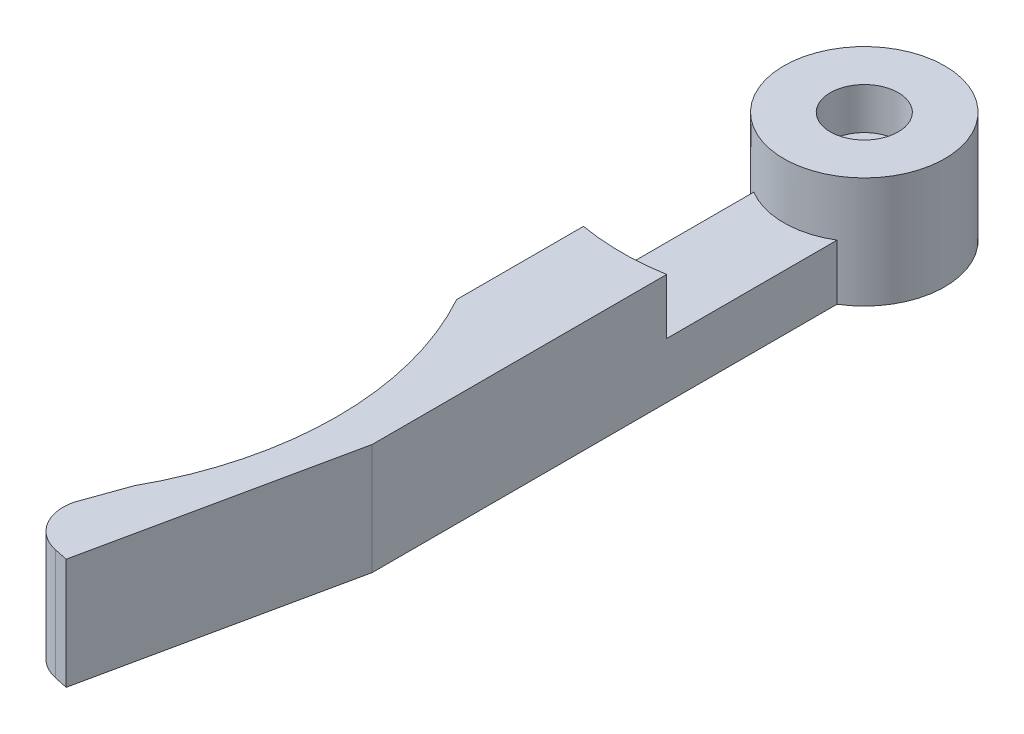
ISO-10303-21;
HEADER;
FILE_DESCRIPTION(('STEP AP214'),'2;1');
FILE_NAME('part.step','',(''),(''),'','','');
FILE_SCHEMA(('AUTOMOTIVE_DESIGN { 1 0 10303 214 1 1 1 1 }'));
ENDSEC;
DATA;
#1=APPLICATION_CONTEXT('core data for automotive mechanical design processes');
#2=APPLICATION_PROTOCOL_DEFINITION('international standard','automotive_design',2000,#1);
#3=PRODUCT_CONTEXT('',#1,'mechanical');
#4=PRODUCT('Part','Part','',(#3));
#5=PRODUCT_RELATED_PRODUCT_CATEGORY('part','',(#4));
#6=PRODUCT_DEFINITION_FORMATION('','',#4);
#7=PRODUCT_DEFINITION_CONTEXT('part definition',#1,'design');
#8=PRODUCT_DEFINITION('design','',#6,#7);
#9=PRODUCT_DEFINITION_SHAPE('','',#8);
#10=(LENGTH_UNIT() NAMED_UNIT(*) SI_UNIT(.MILLI.,.METRE.));
#11=(NAMED_UNIT(*) PLANE_ANGLE_UNIT() SI_UNIT($,.RADIAN.));
#12=(NAMED_UNIT(*) SI_UNIT($,.STERADIAN.) SOLID_ANGLE_UNIT());
#13=UNCERTAINTY_MEASURE_WITH_UNIT(LENGTH_MEASURE(1.E-05),#10,'distance_accuracy_value','');
#14=(GEOMETRIC_REPRESENTATION_CONTEXT(3) GLOBAL_UNCERTAINTY_ASSIGNED_CONTEXT((#13)) GLOBAL_UNIT_ASSIGNED_CONTEXT((#10,
#11,#12)) REPRESENTATION_CONTEXT('',''));
#15=CARTESIAN_POINT('',(0.,0.,0.));
#16=DIRECTION('',(0.,0.,1.));
#17=DIRECTION('',(1.,0.,0.));
#18=AXIS2_PLACEMENT_3D('',#15,#16,#17);
#19=CARTESIAN_POINT('',(0.,8.,0.));
#20=DIRECTION('',(0.,1.,0.));
#21=DIRECTION('',(0.,0.,-1.));
#22=AXIS2_PLACEMENT_3D('',#19,#20,#21);
#23=PLANE('',#22);
#24=CARTESIAN_POINT('',(0.,8.,0.));
#25=DIRECTION('',(0.,-1.,0.));
#26=DIRECTION('',(0.,0.,-1.));
#27=AXIS2_PLACEMENT_3D('',#24,#25,#26);
#28=CIRCLE('',#27,5.8);
#29=CARTESIAN_POINT('',(0.,8.,-5.8));
#30=VERTEX_POINT('',#29);
#31=EDGE_CURVE('E164',#30,#30,#28,.T.);
#32=ORIENTED_EDGE('',*,*,#31,.F.);
#33=EDGE_LOOP('',(#32));
#34=FACE_BOUND('',#33,.T.);
#35=CARTESIAN_POINT('',(0.,8.,0.));
#36=DIRECTION('',(0.,-1.,0.));
#37=DIRECTION('',(0.,0.,-1.));
#38=AXIS2_PLACEMENT_3D('',#35,#36,#37);
#39=CIRCLE('',#38,2.45000000000001);
#40=CARTESIAN_POINT('',(0.,8.,-2.45000000000003));
#41=VERTEX_POINT('',#40);
#42=EDGE_CURVE('E230',#41,#41,#39,.T.);
#43=ORIENTED_EDGE('',*,*,#42,.T.);
#44=EDGE_LOOP('',(#43));
#45=FACE_BOUND('',#44,.T.);
#46=ADVANCED_FACE('F37',(#34,#45),#23,.T.);
#47=CARTESIAN_POINT('',(0.,-0.00100000000000013,0.));
#48=DIRECTION('',(0.,1.,0.));
#49=DIRECTION('',(0.,0.,-1.));
#50=AXIS2_PLACEMENT_3D('',#47,#48,#49);
#51=CYLINDRICAL_SURFACE('',#50,1.25);
#52=CARTESIAN_POINT('',(0.,5.,0.));
#53=DIRECTION('',(0.,-1.,0.));
#54=DIRECTION('',(0.,0.,-1.));
#55=AXIS2_PLACEMENT_3D('',#52,#53,#54);
#56=CIRCLE('',#55,1.25);
#57=CARTESIAN_POINT('',(0.,5.,-1.25000000000002));
#58=VERTEX_POINT('',#57);
#59=EDGE_CURVE('E227',#58,#58,#56,.T.);
#60=ORIENTED_EDGE('',*,*,#59,.F.);
#61=EDGE_LOOP('',(#60));
#62=FACE_BOUND('',#61,.T.);
#63=CARTESIAN_POINT('',(0.,2.,0.));
#64=DIRECTION('',(0.,1.,0.));
#65=DIRECTION('',(0.,0.,1.));
#66=AXIS2_PLACEMENT_3D('',#63,#64,#65);
#67=CIRCLE('',#66,1.25);
#68=CARTESIAN_POINT('',(0.,2.,1.24999999999998));
#69=VERTEX_POINT('',#68);
#70=EDGE_CURVE('E41',#69,#69,#67,.F.);
#71=ORIENTED_EDGE('',*,*,#70,.T.);
#72=EDGE_LOOP('',(#71));
#73=FACE_BOUND('',#72,.T.);
#74=ADVANCED_FACE('F241',(#62,#73),#51,.F.);
#75=CARTESIAN_POINT('',(0.,8.,0.));
#76=DIRECTION('',(0.,-1.,0.));
#77=DIRECTION('',(0.,0.,1.));
#78=AXIS2_PLACEMENT_3D('',#75,#76,#77);
#79=CYLINDRICAL_SURFACE('',#78,5.8);
#80=DIRECTION('',(0.,-1.,0.));
#81=VECTOR('',#80,1.);
#82=CARTESIAN_POINT('',(2.99999999999999,8.,4.96386945839635));
#83=LINE('',#82,#81);
#84=CARTESIAN_POINT('',(2.99999999999999,4.,4.96386945839635));
#85=VERTEX_POINT('',#84);
#86=CARTESIAN_POINT('',(2.99999999999999,0.,4.96386945839635));
#87=VERTEX_POINT('',#86);
#88=EDGE_CURVE('E11',#85,#87,#83,.T.);
#89=ORIENTED_EDGE('',*,*,#88,.T.);
#90=CARTESIAN_POINT('',(0.,0.,0.));
#91=DIRECTION('',(0.,-1.,0.));
#92=DIRECTION('',(0.,0.,-1.));
#93=AXIS2_PLACEMENT_3D('',#90,#91,#92);
#94=CIRCLE('',#93,5.8);
#95=CARTESIAN_POINT('',(-2.99999999999999,0.,4.96386945839635));
#96=VERTEX_POINT('',#95);
#97=EDGE_CURVE('E146',#96,#87,#94,.T.);
#98=ORIENTED_EDGE('',*,*,#97,.F.);
#99=DIRECTION('',(0.,-1.,0.));
#100=VECTOR('',#99,1.);
#101=CARTESIAN_POINT('',(-2.99999999999999,8.,4.96386945839635));
#102=LINE('',#101,#100);
#103=CARTESIAN_POINT('',(-2.99999999999999,4.,4.96386945839635));
#104=VERTEX_POINT('',#103);
#105=EDGE_CURVE('E145',#104,#96,#102,.T.);
#106=ORIENTED_EDGE('',*,*,#105,.F.);
#107=CARTESIAN_POINT('',(0.,4.,0.));
#108=DIRECTION('',(0.,1.,0.));
#109=DIRECTION('',(0.,0.,1.));
#110=AXIS2_PLACEMENT_3D('',#107,#108,#109);
#111=CIRCLE('',#110,5.80000000000002);
#112=EDGE_CURVE('E191',#104,#85,#111,.T.);
#113=ORIENTED_EDGE('',*,*,#112,.T.);
#114=EDGE_LOOP('',(#89,#98,#106,#113));
#115=FACE_BOUND('',#114,.T.);
#116=ORIENTED_EDGE('',*,*,#31,.T.);
#117=EDGE_LOOP('',(#116));
#118=FACE_BOUND('',#117,.T.);
#119=ADVANCED_FACE('F39',(#115,#118),#79,.T.);
#120=CARTESIAN_POINT('',(3.,8.,38.4638694583963));
#121=DIRECTION('',(-1.,0.,0.));
#122=DIRECTION('',(0.,0.,-1.));
#123=AXIS2_PLACEMENT_3D('',#120,#121,#122);
#124=PLANE('',#123);
#125=DIRECTION('',(0.,0.,1.));
#126=VECTOR('',#125,1.);
#127=CARTESIAN_POINT('',(3.,8.,38.4638694583963));
#128=LINE('',#127,#126);
#129=CARTESIAN_POINT('',(3.,8.,17.2409396495667));
#130=VERTEX_POINT('',#129);
#131=CARTESIAN_POINT('',(3.,8.,38.4638694583963));
#132=VERTEX_POINT('',#131);
#133=EDGE_CURVE('E179',#130,#132,#128,.T.);
#134=ORIENTED_EDGE('',*,*,#133,.T.);
#135=DIRECTION('',(0.,-1.,0.));
#136=VECTOR('',#135,1.);
#137=CARTESIAN_POINT('',(3.,8.,38.4638694583963));
#138=LINE('',#137,#136);
#139=CARTESIAN_POINT('',(3.,0.,38.4638694583963));
#140=VERTEX_POINT('',#139);
#141=EDGE_CURVE('E46',#132,#140,#138,.T.);
#142=ORIENTED_EDGE('',*,*,#141,.T.);
#143=DIRECTION('',(0.,0.,1.));
#144=VECTOR('',#143,1.);
#145=CARTESIAN_POINT('',(3.,0.,38.4638694583963));
#146=LINE('',#145,#144);
#147=EDGE_CURVE('E148',#87,#140,#146,.T.);
#148=ORIENTED_EDGE('',*,*,#147,.F.);
#149=ORIENTED_EDGE('',*,*,#88,.F.);
#150=DIRECTION('',(0.,0.,1.));
#151=VECTOR('',#150,1.);
#152=CARTESIAN_POINT('',(2.99999999999999,4.,4.96386945839635));
#153=LINE('',#152,#151);
#154=CARTESIAN_POINT('',(2.99999999999999,4.,17.2409396495667));
#155=VERTEX_POINT('',#154);
#156=EDGE_CURVE('E195',#85,#155,#153,.T.);
#157=ORIENTED_EDGE('',*,*,#156,.T.);
#158=DIRECTION('',(0.,1.,0.));
#159=VECTOR('',#158,1.);
#160=CARTESIAN_POINT('',(2.99999999999999,4.,17.2409396495667));
#161=LINE('',#160,#159);
#162=EDGE_CURVE('E210',#155,#130,#161,.T.);
#163=ORIENTED_EDGE('',*,*,#162,.T.);
#164=EDGE_LOOP('',(#134,#142,#148,#149,#157,#163));
#165=FACE_BOUND('',#164,.T.);
#166=ADVANCED_FACE('F177',(#165),#124,.F.);
#167=CARTESIAN_POINT('',(-0.867157449210331,8.,56.6574148320451));
#168=DIRECTION('',(-0.978147600733806,0.,-0.20791169081776));
#169=DIRECTION('',(0.20791169081776,0.,-0.978147600733806));
#170=AXIS2_PLACEMENT_3D('',#167,#168,#169);
#171=PLANE('',#170);
#172=DIRECTION('',(-0.20791169081776,0.,0.978147600733805));
#173=VECTOR('',#172,1.);
#174=CARTESIAN_POINT('',(-0.867157449210331,0.,56.6574148320451));
#175=LINE('',#174,#173);
#176=CARTESIAN_POINT('',(-0.867157449210331,0.,56.6574148320451));
#177=VERTEX_POINT('',#176);
#178=EDGE_CURVE('E152',#140,#177,#175,.T.);
#179=ORIENTED_EDGE('',*,*,#178,.F.);
#180=ORIENTED_EDGE('',*,*,#141,.F.);
#181=DIRECTION('',(-0.20791169081776,0.,0.978147600733805));
#182=VECTOR('',#181,1.);
#183=CARTESIAN_POINT('',(-0.867157449210331,8.,56.6574148320451));
#184=LINE('',#183,#182);
#185=CARTESIAN_POINT('',(-0.867157449210331,8.,56.6574148320451));
#186=VERTEX_POINT('',#185);
#187=EDGE_CURVE('E102',#132,#186,#184,.T.);
#188=ORIENTED_EDGE('',*,*,#187,.T.);
#189=DIRECTION('',(0.,-1.,0.));
#190=VECTOR('',#189,1.);
#191=CARTESIAN_POINT('',(-0.867157449210331,8.,56.6574148320451));
#192=LINE('',#191,#190);
#193=EDGE_CURVE('E171',#186,#177,#192,.T.);
#194=ORIENTED_EDGE('',*,*,#193,.T.);
#195=EDGE_LOOP('',(#179,#180,#188,#194));
#196=FACE_BOUND('',#195,.T.);
#197=ADVANCED_FACE('F181',(#196),#171,.F.);
#198=CARTESIAN_POINT('',(-1.84530504994414,8.,56.4495031412274));
#199=DIRECTION('',(0.207911690817762,0.,-0.978147600733805));
#200=DIRECTION('',(0.978147600733805,0.,0.207911690817762));
#201=AXIS2_PLACEMENT_3D('',#198,#199,#200);
#202=PLANE('',#201);
#203=DIRECTION('',(-0.978147600733805,0.,-0.207911690817762));
#204=VECTOR('',#203,1.);
#205=CARTESIAN_POINT('',(-1.84530504994414,0.,56.4495031412274));
#206=LINE('',#205,#204);
#207=CARTESIAN_POINT('',(-1.84530504994414,0.,56.4495031412274));
#208=VERTEX_POINT('',#207);
#209=EDGE_CURVE('E155',#177,#208,#206,.T.);
#210=ORIENTED_EDGE('',*,*,#209,.F.);
#211=ORIENTED_EDGE('',*,*,#193,.F.);
#212=DIRECTION('',(-0.978147600733805,0.,-0.207911690817762));
#213=VECTOR('',#212,1.);
#214=CARTESIAN_POINT('',(-1.84530504994414,8.,56.4495031412274));
#215=LINE('',#214,#213);
#216=CARTESIAN_POINT('',(-1.84530504994414,8.,56.4495031412274));
#217=VERTEX_POINT('',#216);
#218=EDGE_CURVE('E138',#186,#217,#215,.T.);
#219=ORIENTED_EDGE('',*,*,#218,.T.);
#220=DIRECTION('',(0.,-1.,0.));
#221=VECTOR('',#220,1.);
#222=CARTESIAN_POINT('',(-1.84530504994414,8.,56.4495031412274));
#223=LINE('',#222,#221);
#224=EDGE_CURVE('E132',#217,#208,#223,.T.);
#225=ORIENTED_EDGE('',*,*,#224,.T.);
#226=EDGE_LOOP('',(#210,#211,#219,#225));
#227=FACE_BOUND('',#226,.T.);
#228=ADVANCED_FACE('F272',(#227),#202,.F.);
#229=CARTESIAN_POINT('',(-1.22156997749086,8.,53.515060339026));
#230=DIRECTION('',(0.,-1.,0.));
#231=DIRECTION('',(0.,0.,1.));
#232=AXIS2_PLACEMENT_3D('',#229,#230,#231);
#233=CYLINDRICAL_SURFACE('',#232,3.);
#234=CARTESIAN_POINT('',(-1.22156997749086,0.,53.515060339026));
#235=DIRECTION('',(0.,-1.,0.));
#236=DIRECTION('',(0.,0.,1.));
#237=AXIS2_PLACEMENT_3D('',#234,#235,#236);
#238=CIRCLE('',#237,3.);
#239=CARTESIAN_POINT('',(-4.14041417555798,0.,52.8219885192194));
#240=VERTEX_POINT('',#239);
#241=EDGE_CURVE('E158',#208,#240,#238,.T.);
#242=ORIENTED_EDGE('',*,*,#241,.F.);
#243=ORIENTED_EDGE('',*,*,#224,.F.);
#244=CARTESIAN_POINT('',(-1.22156997749086,8.,53.515060339026));
#245=DIRECTION('',(0.,-1.,0.));
#246=DIRECTION('',(0.,0.,1.));
#247=AXIS2_PLACEMENT_3D('',#244,#245,#246);
#248=CIRCLE('',#247,3.);
#249=CARTESIAN_POINT('',(-4.14041417555798,8.,52.8219885192194));
#250=VERTEX_POINT('',#249);
#251=EDGE_CURVE('E117',#217,#250,#248,.T.);
#252=ORIENTED_EDGE('',*,*,#251,.T.);
#253=DIRECTION('',(0.,-1.,0.));
#254=VECTOR('',#253,1.);
#255=CARTESIAN_POINT('',(-4.14041417555798,8.,52.8219885192194));
#256=LINE('',#255,#254);
#257=EDGE_CURVE('E126',#250,#240,#256,.T.);
#258=ORIENTED_EDGE('',*,*,#257,.T.);
#259=EDGE_LOOP('',(#242,#243,#252,#258));
#260=FACE_BOUND('',#259,.T.);
#261=ADVANCED_FACE('F135',(#260),#233,.T.);
#262=CARTESIAN_POINT('',(-4.14041417555798,8.,52.8219885192194));
#263=DIRECTION('',(0.942070141352118,0.,0.33541593398764));
#264=DIRECTION('',(-0.33541593398764,0.,0.942070141352118));
#265=AXIS2_PLACEMENT_3D('',#262,#263,#264);
#266=PLANE('',#265);
#267=DIRECTION('',(0.33541593398764,0.,-0.942070141352118));
#268=VECTOR('',#267,1.);
#269=CARTESIAN_POINT('',(-4.14041417555798,0.,52.8219885192194));
#270=LINE('',#269,#268);
#271=CARTESIAN_POINT('',(-3.,0.,49.6189500386222));
#272=VERTEX_POINT('',#271);
#273=EDGE_CURVE('E129',#240,#272,#270,.T.);
#274=ORIENTED_EDGE('',*,*,#273,.F.);
#275=ORIENTED_EDGE('',*,*,#257,.F.);
#276=DIRECTION('',(0.33541593398764,0.,-0.942070141352118));
#277=VECTOR('',#276,1.);
#278=CARTESIAN_POINT('',(-4.14041417555798,8.,52.8219885192194));
#279=LINE('',#278,#277);
#280=CARTESIAN_POINT('',(-3.,8.,49.6189500386222));
#281=VERTEX_POINT('',#280);
#282=EDGE_CURVE('E113',#250,#281,#279,.T.);
#283=ORIENTED_EDGE('',*,*,#282,.T.);
#284=DIRECTION('',(0.,-1.,0.));
#285=VECTOR('',#284,1.);
#286=CARTESIAN_POINT('',(-3.,8.,49.6189500386222));
#287=LINE('',#286,#285);
#288=EDGE_CURVE('E133',#281,#272,#287,.T.);
#289=ORIENTED_EDGE('',*,*,#288,.T.);
#290=EDGE_LOOP('',(#274,#275,#283,#289));
#291=FACE_BOUND('',#290,.T.);
#292=ADVANCED_FACE('F127',(#291),#266,.F.);
#293=CARTESIAN_POINT('',(-24.,8.,38.));
#294=DIRECTION('',(0.,-1.,0.));
#295=DIRECTION('',(0.,0.,1.));
#296=AXIS2_PLACEMENT_3D('',#293,#294,#295);
#297=CYLINDRICAL_SURFACE('',#296,24.);
#298=CARTESIAN_POINT('',(-24.,0.,38.));
#299=DIRECTION('',(0.,1.,0.));
#300=DIRECTION('',(0.,0.,1.));
#301=AXIS2_PLACEMENT_3D('',#298,#299,#300);
#302=CIRCLE('',#301,24.);
#303=CARTESIAN_POINT('',(-2.99999999999999,0.,26.3810499613777));
#304=VERTEX_POINT('',#303);
#305=EDGE_CURVE('E161',#272,#304,#302,.T.);
#306=ORIENTED_EDGE('',*,*,#305,.F.);
#307=ORIENTED_EDGE('',*,*,#288,.F.);
#308=CARTESIAN_POINT('',(-24.,8.,38.));
#309=DIRECTION('',(0.,1.,0.));
#310=DIRECTION('',(0.,0.,1.));
#311=AXIS2_PLACEMENT_3D('',#308,#309,#310);
#312=CIRCLE('',#311,24.);
#313=CARTESIAN_POINT('',(-2.99999999999999,8.,26.3810499613777));
#314=VERTEX_POINT('',#313);
#315=EDGE_CURVE('E120',#281,#314,#312,.T.);
#316=ORIENTED_EDGE('',*,*,#315,.T.);
#317=DIRECTION('',(0.,-1.,0.));
#318=VECTOR('',#317,1.);
#319=CARTESIAN_POINT('',(-2.99999999999999,8.,26.3810499613777));
#320=LINE('',#319,#318);
#321=EDGE_CURVE('E166',#314,#304,#320,.T.);
#322=ORIENTED_EDGE('',*,*,#321,.T.);
#323=EDGE_LOOP('',(#306,#307,#316,#322));
#324=FACE_BOUND('',#323,.T.);
#325=ADVANCED_FACE('F264',(#324),#297,.F.);
#326=CARTESIAN_POINT('',(-2.99999999999999,8.,26.3810499613777));
#327=DIRECTION('',(1.,0.,0.));
#328=DIRECTION('',(0.,0.,1.));
#329=AXIS2_PLACEMENT_3D('',#326,#327,#328);
#330=PLANE('',#329);
#331=DIRECTION('',(0.,0.,-1.));
#332=VECTOR('',#331,1.);
#333=CARTESIAN_POINT('',(-2.99999999999999,4.,4.96386945839635));
#334=LINE('',#333,#332);
#335=CARTESIAN_POINT('',(-2.99999999999999,4.,17.2409396495666));
#336=VERTEX_POINT('',#335);
#337=EDGE_CURVE('E207',#336,#104,#334,.T.);
#338=ORIENTED_EDGE('',*,*,#337,.T.);
#339=ORIENTED_EDGE('',*,*,#105,.T.);
#340=DIRECTION('',(0.,0.,-1.));
#341=VECTOR('',#340,1.);
#342=CARTESIAN_POINT('',(-2.99999999999999,0.,26.3810499613777));
#343=LINE('',#342,#341);
#344=EDGE_CURVE('E94',#304,#96,#343,.T.);
#345=ORIENTED_EDGE('',*,*,#344,.F.);
#346=ORIENTED_EDGE('',*,*,#321,.F.);
#347=DIRECTION('',(0.,0.,-1.));
#348=VECTOR('',#347,1.);
#349=CARTESIAN_POINT('',(-2.99999999999999,8.,26.3810499613777));
#350=LINE('',#349,#348);
#351=CARTESIAN_POINT('',(-2.99999999999999,8.,17.2409396495666));
#352=VERTEX_POINT('',#351);
#353=EDGE_CURVE('E61',#314,#352,#350,.T.);
#354=ORIENTED_EDGE('',*,*,#353,.T.);
#355=DIRECTION('',(0.,1.,0.));
#356=VECTOR('',#355,1.);
#357=CARTESIAN_POINT('',(-2.99999999999999,4.,17.2409396495666));
#358=LINE('',#357,#356);
#359=EDGE_CURVE('E209',#336,#352,#358,.T.);
#360=ORIENTED_EDGE('',*,*,#359,.F.);
#361=EDGE_LOOP('',(#338,#339,#345,#346,#354,#360));
#362=FACE_BOUND('',#361,.T.);
#363=ADVANCED_FACE('F208',(#362),#330,.F.);
#364=CARTESIAN_POINT('',(0.,8.,0.));
#365=DIRECTION('',(0.,-1.,0.));
#366=DIRECTION('',(0.,0.,1.));
#367=AXIS2_PLACEMENT_3D('',#364,#365,#366);
#368=CIRCLE('',#367,17.5);
#369=EDGE_CURVE('E53',#130,#352,#368,.T.);
#370=ORIENTED_EDGE('',*,*,#369,.T.);
#371=ORIENTED_EDGE('',*,*,#353,.F.);
#372=ORIENTED_EDGE('',*,*,#315,.F.);
#373=ORIENTED_EDGE('',*,*,#282,.F.);
#374=ORIENTED_EDGE('',*,*,#251,.F.);
#375=ORIENTED_EDGE('',*,*,#218,.F.);
#376=ORIENTED_EDGE('',*,*,#187,.F.);
#377=ORIENTED_EDGE('',*,*,#133,.F.);
#378=EDGE_LOOP('',(#370,#371,#372,#373,#374,#375,#376,#377));
#379=FACE_BOUND('',#378,.T.);
#380=ADVANCED_FACE('F115',(#379),#23,.T.);
#381=CARTESIAN_POINT('',(0.,0.,0.));
#382=DIRECTION('',(0.,1.,0.));
#383=DIRECTION('',(0.,0.,-1.));
#384=AXIS2_PLACEMENT_3D('',#381,#382,#383);
#385=PLANE('',#384);
#386=CARTESIAN_POINT('',(0.,0.,0.));
#387=DIRECTION('',(0.,1.,0.));
#388=DIRECTION('',(0.,0.,1.));
#389=AXIS2_PLACEMENT_3D('',#386,#387,#388);
#390=CIRCLE('',#389,3.);
#391=CARTESIAN_POINT('',(0.,0.,2.99999999999998));
#392=VERTEX_POINT('',#391);
#393=EDGE_CURVE('E220',#392,#392,#390,.T.);
#394=ORIENTED_EDGE('',*,*,#393,.T.);
#395=EDGE_LOOP('',(#394));
#396=FACE_BOUND('',#395,.T.);
#397=ORIENTED_EDGE('',*,*,#97,.T.);
#398=ORIENTED_EDGE('',*,*,#147,.T.);
#399=ORIENTED_EDGE('',*,*,#178,.T.);
#400=ORIENTED_EDGE('',*,*,#209,.T.);
#401=ORIENTED_EDGE('',*,*,#241,.T.);
#402=ORIENTED_EDGE('',*,*,#273,.T.);
#403=ORIENTED_EDGE('',*,*,#305,.T.);
#404=ORIENTED_EDGE('',*,*,#344,.T.);
#405=EDGE_LOOP('',(#397,#398,#399,#400,#401,#402,#403,#404));
#406=FACE_BOUND('',#405,.T.);
#407=ADVANCED_FACE('F183',(#396,#406),#385,.F.);
#408=CARTESIAN_POINT('',(0.,5.,0.));
#409=DIRECTION('',(0.,1.,0.));
#410=DIRECTION('',(0.,0.,-1.));
#411=AXIS2_PLACEMENT_3D('',#408,#409,#410);
#412=CYLINDRICAL_SURFACE('',#411,2.45000000000001);
#413=CARTESIAN_POINT('',(0.,5.,0.));
#414=DIRECTION('',(0.,-1.,0.));
#415=DIRECTION('',(0.,0.,-1.));
#416=AXIS2_PLACEMENT_3D('',#413,#414,#415);
#417=CIRCLE('',#416,2.45000000000001);
#418=CARTESIAN_POINT('',(0.,5.,-2.45000000000003));
#419=VERTEX_POINT('',#418);
#420=EDGE_CURVE('E149',#419,#419,#417,.T.);
#421=ORIENTED_EDGE('',*,*,#420,.T.);
#422=EDGE_LOOP('',(#421));
#423=FACE_BOUND('',#422,.T.);
#424=ORIENTED_EDGE('',*,*,#42,.F.);
#425=EDGE_LOOP('',(#424));
#426=FACE_BOUND('',#425,.T.);
#427=ADVANCED_FACE('F245',(#423,#426),#412,.F.);
#428=CARTESIAN_POINT('',(0.,5.,0.));
#429=DIRECTION('',(0.,1.,0.));
#430=DIRECTION('',(0.,0.,-1.));
#431=AXIS2_PLACEMENT_3D('',#428,#429,#430);
#432=PLANE('',#431);
#433=ORIENTED_EDGE('',*,*,#59,.T.);
#434=EDGE_LOOP('',(#433));
#435=FACE_BOUND('',#434,.T.);
#436=ORIENTED_EDGE('',*,*,#420,.F.);
#437=EDGE_LOOP('',(#436));
#438=FACE_BOUND('',#437,.T.);
#439=ADVANCED_FACE('F247',(#435,#438),#432,.T.);
#440=CARTESIAN_POINT('',(0.,2.,0.));
#441=DIRECTION('',(0.,-1.,0.));
#442=DIRECTION('',(0.,0.,1.));
#443=AXIS2_PLACEMENT_3D('',#440,#441,#442);
#444=PLANE('',#443);
#445=CARTESIAN_POINT('',(0.,2.,0.));
#446=DIRECTION('',(0.,1.,0.));
#447=DIRECTION('',(0.,0.,1.));
#448=AXIS2_PLACEMENT_3D('',#445,#446,#447);
#449=CIRCLE('',#448,3.);
#450=CARTESIAN_POINT('',(0.,2.,2.99999999999998));
#451=VERTEX_POINT('',#450);
#452=EDGE_CURVE('E222',#451,#451,#449,.T.);
#453=ORIENTED_EDGE('',*,*,#452,.F.);
#454=EDGE_LOOP('',(#453));
#455=FACE_BOUND('',#454,.T.);
#456=ORIENTED_EDGE('',*,*,#70,.F.);
#457=EDGE_LOOP('',(#456));
#458=FACE_BOUND('',#457,.T.);
#459=ADVANCED_FACE('F254',(#455,#458),#444,.T.);
#460=CARTESIAN_POINT('',(0.,2.,0.));
#461=DIRECTION('',(0.,-1.,0.));
#462=DIRECTION('',(0.,0.,1.));
#463=AXIS2_PLACEMENT_3D('',#460,#461,#462);
#464=CYLINDRICAL_SURFACE('',#463,3.);
#465=ORIENTED_EDGE('',*,*,#452,.T.);
#466=EDGE_LOOP('',(#465));
#467=FACE_BOUND('',#466,.T.);
#468=ORIENTED_EDGE('',*,*,#393,.F.);
#469=EDGE_LOOP('',(#468));
#470=FACE_BOUND('',#469,.T.);
#471=ADVANCED_FACE('F290',(#467,#470),#464,.F.);
#472=CARTESIAN_POINT('',(0.,4.,0.));
#473=DIRECTION('',(0.,1.,0.));
#474=DIRECTION('',(0.,0.,-1.));
#475=AXIS2_PLACEMENT_3D('',#472,#473,#474);
#476=CYLINDRICAL_SURFACE('',#475,17.5);
#477=ORIENTED_EDGE('',*,*,#369,.F.);
#478=ORIENTED_EDGE('',*,*,#162,.F.);
#479=CARTESIAN_POINT('',(0.,4.,0.));
#480=DIRECTION('',(0.,-1.,0.));
#481=DIRECTION('',(0.,0.,1.));
#482=AXIS2_PLACEMENT_3D('',#479,#480,#481);
#483=CIRCLE('',#482,17.5);
#484=EDGE_CURVE('E211',#155,#336,#483,.T.);
#485=ORIENTED_EDGE('',*,*,#484,.T.);
#486=ORIENTED_EDGE('',*,*,#359,.T.);
#487=EDGE_LOOP('',(#477,#478,#485,#486));
#488=FACE_BOUND('',#487,.T.);
#489=ADVANCED_FACE('F293',(#488),#476,.F.);
#490=CARTESIAN_POINT('',(0.,4.,0.));
#491=DIRECTION('',(0.,-1.,0.));
#492=DIRECTION('',(0.,0.,1.));
#493=AXIS2_PLACEMENT_3D('',#490,#491,#492);
#494=PLANE('',#493);
#495=ORIENTED_EDGE('',*,*,#112,.F.);
#496=ORIENTED_EDGE('',*,*,#337,.F.);
#497=ORIENTED_EDGE('',*,*,#484,.F.);
#498=ORIENTED_EDGE('',*,*,#156,.F.);
#499=EDGE_LOOP('',(#495,#496,#497,#498));
#500=FACE_BOUND('',#499,.T.);
#501=ADVANCED_FACE('F213',(#500),#494,.F.);
#502=CLOSED_SHELL('',(#46,#74,#119,#166,#197,#228,#261,#292,#325,#363,#380,#407,#427,#439,#459,
#471,#489,#501));
#503=MANIFOLD_SOLID_BREP('B2',#502);
#504=ADVANCED_BREP_SHAPE_REPRESENTATION('',(#18,#503),#14);
#505=SHAPE_DEFINITION_REPRESENTATION(#9,#504);
ENDSEC;
END-ISO-10303-21;
